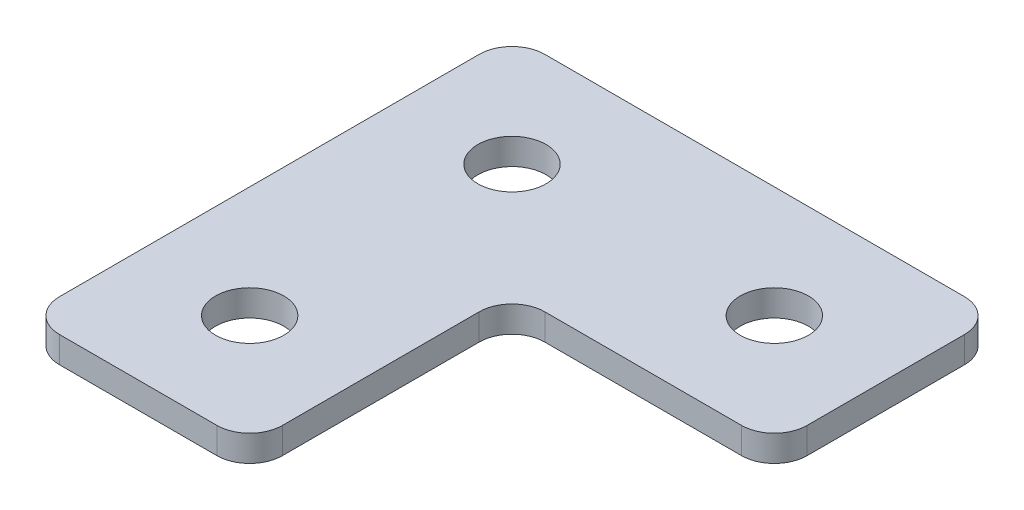
ISO-10303-21;
HEADER;
FILE_DESCRIPTION(('STEP AP214'),'2;1');
FILE_NAME('part.step','',(''),(''),'','','');
FILE_SCHEMA(('AUTOMOTIVE_DESIGN { 1 0 10303 214 1 1 1 1 }'));
ENDSEC;
DATA;
#1=APPLICATION_CONTEXT('core data for automotive mechanical design processes');
#2=APPLICATION_PROTOCOL_DEFINITION('international standard','automotive_design',2000,#1);
#3=PRODUCT_CONTEXT('',#1,'mechanical');
#4=PRODUCT('Part','Part','',(#3));
#5=PRODUCT_RELATED_PRODUCT_CATEGORY('part','',(#4));
#6=PRODUCT_DEFINITION_FORMATION('','',#4);
#7=PRODUCT_DEFINITION_CONTEXT('part definition',#1,'design');
#8=PRODUCT_DEFINITION('design','',#6,#7);
#9=PRODUCT_DEFINITION_SHAPE('','',#8);
#10=(LENGTH_UNIT() NAMED_UNIT(*) SI_UNIT(.MILLI.,.METRE.));
#11=(NAMED_UNIT(*) PLANE_ANGLE_UNIT() SI_UNIT($,.RADIAN.));
#12=(NAMED_UNIT(*) SI_UNIT($,.STERADIAN.) SOLID_ANGLE_UNIT());
#13=UNCERTAINTY_MEASURE_WITH_UNIT(LENGTH_MEASURE(1.E-05),#10,'distance_accuracy_value','');
#14=(GEOMETRIC_REPRESENTATION_CONTEXT(3) GLOBAL_UNCERTAINTY_ASSIGNED_CONTEXT((#13)) GLOBAL_UNIT_ASSIGNED_CONTEXT((#10,
#11,#12)) REPRESENTATION_CONTEXT('',''));
#15=CARTESIAN_POINT('',(0.,0.,0.));
#16=DIRECTION('',(0.,0.,1.));
#17=DIRECTION('',(1.,0.,0.));
#18=AXIS2_PLACEMENT_3D('',#15,#16,#17);
#19=CARTESIAN_POINT('',(20.5676190476191,-1.,-12.9790476190476));
#20=DIRECTION('',(0.,-1.,0.));
#21=DIRECTION('',(0.,0.,-1.));
#22=AXIS2_PLACEMENT_3D('',#19,#20,#21);
#23=PLANE('',#22);
#24=CARTESIAN_POINT('',(20.5676190476191,-1.,7.02095238095242));
#25=DIRECTION('',(0.,1.,0.));
#26=DIRECTION('',(0.,0.,1.));
#27=AXIS2_PLACEMENT_3D('',#24,#25,#26);
#28=CIRCLE('',#27,2.6);
#29=CARTESIAN_POINT('',(20.5676190476191,-1.,9.62095238095242));
#30=VERTEX_POINT('',#29);
#31=EDGE_CURVE('E310',#30,#30,#28,.T.);
#32=ORIENTED_EDGE('',*,*,#31,.T.);
#33=EDGE_LOOP('',(#32));
#34=FACE_BOUND('',#33,.T.);
#35=CARTESIAN_POINT('',(40.5676190476191,-1.,-12.9790476190476));
#36=DIRECTION('',(0.,1.,0.));
#37=DIRECTION('',(0.,0.,1.));
#38=AXIS2_PLACEMENT_3D('',#35,#36,#37);
#39=CIRCLE('',#38,2.6);
#40=CARTESIAN_POINT('',(40.5676190476191,-1.,-10.3790476190476));
#41=VERTEX_POINT('',#40);
#42=EDGE_CURVE('E305',#41,#41,#39,.T.);
#43=ORIENTED_EDGE('',*,*,#42,.T.);
#44=EDGE_LOOP('',(#43));
#45=FACE_BOUND('',#44,.T.);
#46=CARTESIAN_POINT('',(20.5676190476191,-1.,-12.9790476190476));
#47=DIRECTION('',(0.,1.,0.));
#48=DIRECTION('',(0.,0.,1.));
#49=AXIS2_PLACEMENT_3D('',#46,#47,#48);
#50=CIRCLE('',#49,2.6);
#51=CARTESIAN_POINT('',(20.5676190476191,-1.,-10.3790476190476));
#52=VERTEX_POINT('',#51);
#53=EDGE_CURVE('E187',#52,#52,#50,.T.);
#54=ORIENTED_EDGE('',*,*,#53,.T.);
#55=EDGE_LOOP('',(#54));
#56=FACE_BOUND('',#55,.T.);
#57=DIRECTION('',(-1.,0.,0.));
#58=VECTOR('',#57,1.);
#59=CARTESIAN_POINT('',(49.0676190476191,-1.,-21.4790476190476));
#60=LINE('',#59,#58);
#61=CARTESIAN_POINT('',(46.5676190476191,-1.,-21.4790476190476));
#62=VERTEX_POINT('',#61);
#63=CARTESIAN_POINT('',(14.5676190476191,-1.,-21.4790476190476));
#64=VERTEX_POINT('',#63);
#65=EDGE_CURVE('E208',#62,#64,#60,.T.);
#66=ORIENTED_EDGE('',*,*,#65,.F.);
#67=CARTESIAN_POINT('',(46.5676190476191,-1.,-18.9790476190476));
#68=DIRECTION('',(0.,-1.,0.));
#69=DIRECTION('',(0.,0.,-1.));
#70=AXIS2_PLACEMENT_3D('',#67,#68,#69);
#71=CIRCLE('',#70,2.5);
#72=CARTESIAN_POINT('',(49.0676190476191,-1.,-18.9790476190476));
#73=VERTEX_POINT('',#72);
#74=EDGE_CURVE('E159',#62,#73,#71,.T.);
#75=ORIENTED_EDGE('',*,*,#74,.T.);
#76=DIRECTION('',(0.,0.,-1.));
#77=VECTOR('',#76,1.);
#78=CARTESIAN_POINT('',(49.0676190476191,-1.,-4.47904761904754));
#79=LINE('',#78,#77);
#80=CARTESIAN_POINT('',(49.0676190476191,-1.,-6.97904761904754));
#81=VERTEX_POINT('',#80);
#82=EDGE_CURVE('E217',#81,#73,#79,.T.);
#83=ORIENTED_EDGE('',*,*,#82,.F.);
#84=CARTESIAN_POINT('',(46.5676190476191,-1.,-6.97904761904754));
#85=DIRECTION('',(0.,-1.,0.));
#86=DIRECTION('',(0.,0.,-1.));
#87=AXIS2_PLACEMENT_3D('',#84,#85,#86);
#88=CIRCLE('',#87,2.5);
#89=CARTESIAN_POINT('',(46.5676190476191,-1.,-4.47904761904754));
#90=VERTEX_POINT('',#89);
#91=EDGE_CURVE('E131',#81,#90,#88,.T.);
#92=ORIENTED_EDGE('',*,*,#91,.T.);
#93=DIRECTION('',(1.,0.,0.));
#94=VECTOR('',#93,1.);
#95=CARTESIAN_POINT('',(29.0676190476192,-1.,-4.47904761904754));
#96=LINE('',#95,#94);
#97=CARTESIAN_POINT('',(31.5676190476192,-1.,-4.47904761904754));
#98=VERTEX_POINT('',#97);
#99=EDGE_CURVE('E194',#98,#90,#96,.T.);
#100=ORIENTED_EDGE('',*,*,#99,.F.);
#101=CARTESIAN_POINT('',(31.5676190476192,-1.,-1.97904761904754));
#102=DIRECTION('',(0.,-1.,0.));
#103=DIRECTION('',(0.,0.,-1.));
#104=AXIS2_PLACEMENT_3D('',#101,#102,#103);
#105=CIRCLE('',#104,2.5);
#106=CARTESIAN_POINT('',(29.0676190476192,-1.,-1.97904761904754));
#107=VERTEX_POINT('',#106);
#108=EDGE_CURVE('E10',#98,#107,#105,.F.);
#109=ORIENTED_EDGE('',*,*,#108,.T.);
#110=DIRECTION('',(0.,0.,-1.));
#111=VECTOR('',#110,1.);
#112=CARTESIAN_POINT('',(29.0676190476192,-1.,15.5209523809524));
#113=LINE('',#112,#111);
#114=CARTESIAN_POINT('',(29.0676190476192,-1.,13.0209523809524));
#115=VERTEX_POINT('',#114);
#116=EDGE_CURVE('E132',#115,#107,#113,.T.);
#117=ORIENTED_EDGE('',*,*,#116,.F.);
#118=CARTESIAN_POINT('',(26.5676190476192,-1.,13.0209523809524));
#119=DIRECTION('',(0.,-1.,0.));
#120=DIRECTION('',(0.,0.,-1.));
#121=AXIS2_PLACEMENT_3D('',#118,#119,#120);
#122=CIRCLE('',#121,2.5);
#123=CARTESIAN_POINT('',(26.5676190476192,-1.,15.5209523809524));
#124=VERTEX_POINT('',#123);
#125=EDGE_CURVE('E153',#115,#124,#122,.T.);
#126=ORIENTED_EDGE('',*,*,#125,.T.);
#127=DIRECTION('',(1.,0.,0.));
#128=VECTOR('',#127,1.);
#129=CARTESIAN_POINT('',(12.0676190476191,-1.,15.5209523809524));
#130=LINE('',#129,#128);
#131=CARTESIAN_POINT('',(14.5676190476191,-1.,15.5209523809524));
#132=VERTEX_POINT('',#131);
#133=EDGE_CURVE('E136',#132,#124,#130,.T.);
#134=ORIENTED_EDGE('',*,*,#133,.F.);
#135=CARTESIAN_POINT('',(14.5676190476191,-1.,13.0209523809524));
#136=DIRECTION('',(0.,-1.,0.));
#137=DIRECTION('',(0.,0.,-1.));
#138=AXIS2_PLACEMENT_3D('',#135,#136,#137);
#139=CIRCLE('',#138,2.5);
#140=CARTESIAN_POINT('',(12.0676190476191,-1.,13.0209523809524));
#141=VERTEX_POINT('',#140);
#142=EDGE_CURVE('E31',#132,#141,#139,.T.);
#143=ORIENTED_EDGE('',*,*,#142,.T.);
#144=DIRECTION('',(0.,0.,1.));
#145=VECTOR('',#144,1.);
#146=CARTESIAN_POINT('',(12.0676190476191,-1.,-21.4790476190476));
#147=LINE('',#146,#145);
#148=CARTESIAN_POINT('',(12.0676190476191,-1.,-18.9790476190476));
#149=VERTEX_POINT('',#148);
#150=EDGE_CURVE('E206',#149,#141,#147,.T.);
#151=ORIENTED_EDGE('',*,*,#150,.F.);
#152=CARTESIAN_POINT('',(14.5676190476191,-1.,-18.9790476190476));
#153=DIRECTION('',(0.,-1.,0.));
#154=DIRECTION('',(0.,0.,-1.));
#155=AXIS2_PLACEMENT_3D('',#152,#153,#154);
#156=CIRCLE('',#155,2.5);
#157=EDGE_CURVE('E157',#149,#64,#156,.T.);
#158=ORIENTED_EDGE('',*,*,#157,.T.);
#159=EDGE_LOOP('',(#66,#75,#83,#92,#100,#109,#117,#126,#134,#143,#151,#158));
#160=FACE_BOUND('',#159,.T.);
#161=ADVANCED_FACE('F16',(#34,#45,#56,#160),#23,.T.);
#162=CARTESIAN_POINT('',(29.0676190476192,-1.,-4.47904761904754));
#163=DIRECTION('',(0.,0.,1.));
#164=DIRECTION('',(1.,0.,0.));
#165=AXIS2_PLACEMENT_3D('',#162,#163,#164);
#166=PLANE('',#165);
#167=DIRECTION('',(1.,0.,0.));
#168=VECTOR('',#167,1.);
#169=CARTESIAN_POINT('',(29.0676190476192,1.,-4.47904761904754));
#170=LINE('',#169,#168);
#171=CARTESIAN_POINT('',(31.5676190476192,1.,-4.47904761904754));
#172=VERTEX_POINT('',#171);
#173=CARTESIAN_POINT('',(46.5676190476191,1.,-4.47904761904754));
#174=VERTEX_POINT('',#173);
#175=EDGE_CURVE('E111',#172,#174,#170,.T.);
#176=ORIENTED_EDGE('',*,*,#175,.F.);
#177=DIRECTION('',(0.,1.,0.));
#178=VECTOR('',#177,1.);
#179=CARTESIAN_POINT('',(31.5676190476192,-1.,-4.47904761904754));
#180=LINE('',#179,#178);
#181=EDGE_CURVE('E177',#172,#98,#180,.F.);
#182=ORIENTED_EDGE('',*,*,#181,.T.);
#183=ORIENTED_EDGE('',*,*,#99,.T.);
#184=DIRECTION('',(0.,1.,0.));
#185=VECTOR('',#184,1.);
#186=CARTESIAN_POINT('',(46.5676190476191,-1.,-4.47904761904754));
#187=LINE('',#186,#185);
#188=EDGE_CURVE('E175',#90,#174,#187,.T.);
#189=ORIENTED_EDGE('',*,*,#188,.T.);
#190=EDGE_LOOP('',(#176,#182,#183,#189));
#191=FACE_BOUND('',#190,.T.);
#192=ADVANCED_FACE('F184',(#191),#166,.T.);
#193=CARTESIAN_POINT('',(29.0676190476192,-1.,15.5209523809524));
#194=DIRECTION('',(1.,0.,0.));
#195=DIRECTION('',(0.,0.,-1.));
#196=AXIS2_PLACEMENT_3D('',#193,#194,#195);
#197=PLANE('',#196);
#198=ORIENTED_EDGE('',*,*,#116,.T.);
#199=DIRECTION('',(0.,1.,0.));
#200=VECTOR('',#199,1.);
#201=CARTESIAN_POINT('',(29.0676190476192,1.,-1.97904761904754));
#202=LINE('',#201,#200);
#203=CARTESIAN_POINT('',(29.0676190476192,1.,-1.97904761904754));
#204=VERTEX_POINT('',#203);
#205=EDGE_CURVE('E172',#107,#204,#202,.T.);
#206=ORIENTED_EDGE('',*,*,#205,.T.);
#207=DIRECTION('',(0.,0.,-1.));
#208=VECTOR('',#207,1.);
#209=CARTESIAN_POINT('',(29.0676190476192,1.,15.5209523809524));
#210=LINE('',#209,#208);
#211=CARTESIAN_POINT('',(29.0676190476192,1.,13.0209523809524));
#212=VERTEX_POINT('',#211);
#213=EDGE_CURVE('E139',#212,#204,#210,.T.);
#214=ORIENTED_EDGE('',*,*,#213,.F.);
#215=DIRECTION('',(0.,1.,0.));
#216=VECTOR('',#215,1.);
#217=CARTESIAN_POINT('',(29.0676190476192,-1.,13.0209523809524));
#218=LINE('',#217,#216);
#219=EDGE_CURVE('E170',#212,#115,#218,.F.);
#220=ORIENTED_EDGE('',*,*,#219,.T.);
#221=EDGE_LOOP('',(#198,#206,#214,#220));
#222=FACE_BOUND('',#221,.T.);
#223=ADVANCED_FACE('F196',(#222),#197,.T.);
#224=CARTESIAN_POINT('',(12.0676190476191,-1.,15.5209523809524));
#225=DIRECTION('',(0.,0.,1.));
#226=DIRECTION('',(1.,0.,0.));
#227=AXIS2_PLACEMENT_3D('',#224,#225,#226);
#228=PLANE('',#227);
#229=DIRECTION('',(1.,0.,0.));
#230=VECTOR('',#229,1.);
#231=CARTESIAN_POINT('',(12.0676190476191,1.,15.5209523809524));
#232=LINE('',#231,#230);
#233=CARTESIAN_POINT('',(14.5676190476191,1.,15.5209523809524));
#234=VERTEX_POINT('',#233);
#235=CARTESIAN_POINT('',(26.5676190476192,1.,15.5209523809524));
#236=VERTEX_POINT('',#235);
#237=EDGE_CURVE('E216',#234,#236,#232,.T.);
#238=ORIENTED_EDGE('',*,*,#237,.F.);
#239=DIRECTION('',(0.,1.,0.));
#240=VECTOR('',#239,1.);
#241=CARTESIAN_POINT('',(14.5676190476191,-1.,15.5209523809524));
#242=LINE('',#241,#240);
#243=EDGE_CURVE('E168',#234,#132,#242,.F.);
#244=ORIENTED_EDGE('',*,*,#243,.T.);
#245=ORIENTED_EDGE('',*,*,#133,.T.);
#246=DIRECTION('',(0.,1.,0.));
#247=VECTOR('',#246,1.);
#248=CARTESIAN_POINT('',(26.5676190476192,-1.,15.5209523809524));
#249=LINE('',#248,#247);
#250=EDGE_CURVE('E165',#124,#236,#249,.T.);
#251=ORIENTED_EDGE('',*,*,#250,.T.);
#252=EDGE_LOOP('',(#238,#244,#245,#251));
#253=FACE_BOUND('',#252,.T.);
#254=ADVANCED_FACE('F203',(#253),#228,.T.);
#255=CARTESIAN_POINT('',(12.0676190476191,-1.,-21.4790476190476));
#256=DIRECTION('',(-1.,0.,0.));
#257=DIRECTION('',(0.,0.,1.));
#258=AXIS2_PLACEMENT_3D('',#255,#256,#257);
#259=PLANE('',#258);
#260=DIRECTION('',(0.,0.,1.));
#261=VECTOR('',#260,1.);
#262=CARTESIAN_POINT('',(12.0676190476191,1.,-21.4790476190476));
#263=LINE('',#262,#261);
#264=CARTESIAN_POINT('',(12.0676190476191,1.,-18.9790476190476));
#265=VERTEX_POINT('',#264);
#266=CARTESIAN_POINT('',(12.0676190476191,1.,13.0209523809524));
#267=VERTEX_POINT('',#266);
#268=EDGE_CURVE('E214',#265,#267,#263,.T.);
#269=ORIENTED_EDGE('',*,*,#268,.F.);
#270=DIRECTION('',(0.,1.,0.));
#271=VECTOR('',#270,1.);
#272=CARTESIAN_POINT('',(12.0676190476191,-1.,-18.9790476190476));
#273=LINE('',#272,#271);
#274=EDGE_CURVE('E38',#265,#149,#273,.F.);
#275=ORIENTED_EDGE('',*,*,#274,.T.);
#276=ORIENTED_EDGE('',*,*,#150,.T.);
#277=DIRECTION('',(0.,1.,0.));
#278=VECTOR('',#277,1.);
#279=CARTESIAN_POINT('',(12.0676190476191,-1.,13.0209523809524));
#280=LINE('',#279,#278);
#281=EDGE_CURVE('E161',#141,#267,#280,.T.);
#282=ORIENTED_EDGE('',*,*,#281,.T.);
#283=EDGE_LOOP('',(#269,#275,#276,#282));
#284=FACE_BOUND('',#283,.T.);
#285=ADVANCED_FACE('F233',(#284),#259,.T.);
#286=CARTESIAN_POINT('',(49.0676190476191,-1.,-21.4790476190476));
#287=DIRECTION('',(0.,0.,-1.));
#288=DIRECTION('',(-1.,0.,0.));
#289=AXIS2_PLACEMENT_3D('',#286,#287,#288);
#290=PLANE('',#289);
#291=DIRECTION('',(-1.,0.,0.));
#292=VECTOR('',#291,1.);
#293=CARTESIAN_POINT('',(49.0676190476191,1.,-21.4790476190476));
#294=LINE('',#293,#292);
#295=CARTESIAN_POINT('',(46.5676190476191,1.,-21.4790476190476));
#296=VERTEX_POINT('',#295);
#297=CARTESIAN_POINT('',(14.5676190476191,1.,-21.4790476190476));
#298=VERTEX_POINT('',#297);
#299=EDGE_CURVE('E127',#296,#298,#294,.T.);
#300=ORIENTED_EDGE('',*,*,#299,.F.);
#301=DIRECTION('',(0.,1.,0.));
#302=VECTOR('',#301,1.);
#303=CARTESIAN_POINT('',(46.5676190476191,-1.,-21.4790476190476));
#304=LINE('',#303,#302);
#305=EDGE_CURVE('E151',#296,#62,#304,.F.);
#306=ORIENTED_EDGE('',*,*,#305,.T.);
#307=ORIENTED_EDGE('',*,*,#65,.T.);
#308=DIRECTION('',(0.,1.,0.));
#309=VECTOR('',#308,1.);
#310=CARTESIAN_POINT('',(14.5676190476191,-1.,-21.4790476190476));
#311=LINE('',#310,#309);
#312=EDGE_CURVE('E148',#64,#298,#311,.T.);
#313=ORIENTED_EDGE('',*,*,#312,.T.);
#314=EDGE_LOOP('',(#300,#306,#307,#313));
#315=FACE_BOUND('',#314,.T.);
#316=ADVANCED_FACE('F227',(#315),#290,.T.);
#317=CARTESIAN_POINT('',(49.0676190476191,-1.,-4.47904761904754));
#318=DIRECTION('',(1.,0.,0.));
#319=DIRECTION('',(0.,0.,-1.));
#320=AXIS2_PLACEMENT_3D('',#317,#318,#319);
#321=PLANE('',#320);
#322=ORIENTED_EDGE('',*,*,#82,.T.);
#323=DIRECTION('',(0.,1.,0.));
#324=VECTOR('',#323,1.);
#325=CARTESIAN_POINT('',(49.0676190476191,-1.,-18.9790476190476));
#326=LINE('',#325,#324);
#327=CARTESIAN_POINT('',(49.0676190476191,1.,-18.9790476190476));
#328=VERTEX_POINT('',#327);
#329=EDGE_CURVE('E126',#73,#328,#326,.T.);
#330=ORIENTED_EDGE('',*,*,#329,.T.);
#331=DIRECTION('',(0.,0.,-1.));
#332=VECTOR('',#331,1.);
#333=CARTESIAN_POINT('',(49.0676190476191,1.,-4.47904761904754));
#334=LINE('',#333,#332);
#335=CARTESIAN_POINT('',(49.0676190476191,1.,-6.97904761904754));
#336=VERTEX_POINT('',#335);
#337=EDGE_CURVE('E109',#336,#328,#334,.T.);
#338=ORIENTED_EDGE('',*,*,#337,.F.);
#339=DIRECTION('',(0.,1.,0.));
#340=VECTOR('',#339,1.);
#341=CARTESIAN_POINT('',(49.0676190476191,-1.,-6.97904761904754));
#342=LINE('',#341,#340);
#343=EDGE_CURVE('E123',#336,#81,#342,.F.);
#344=ORIENTED_EDGE('',*,*,#343,.T.);
#345=EDGE_LOOP('',(#322,#330,#338,#344));
#346=FACE_BOUND('',#345,.T.);
#347=ADVANCED_FACE('F122',(#346),#321,.T.);
#348=CARTESIAN_POINT('',(20.5676190476191,1.,-12.9790476190476));
#349=DIRECTION('',(0.,-1.,0.));
#350=DIRECTION('',(0.,0.,-1.));
#351=AXIS2_PLACEMENT_3D('',#348,#349,#350);
#352=PLANE('',#351);
#353=CARTESIAN_POINT('',(20.5676190476191,1.,7.02095238095242));
#354=DIRECTION('',(0.,1.,0.));
#355=DIRECTION('',(0.,0.,1.));
#356=AXIS2_PLACEMENT_3D('',#353,#354,#355);
#357=CIRCLE('',#356,2.6);
#358=CARTESIAN_POINT('',(20.5676190476191,1.,9.62095238095242));
#359=VERTEX_POINT('',#358);
#360=EDGE_CURVE('E297',#359,#359,#357,.T.);
#361=ORIENTED_EDGE('',*,*,#360,.F.);
#362=EDGE_LOOP('',(#361));
#363=FACE_BOUND('',#362,.T.);
#364=CARTESIAN_POINT('',(40.5676190476191,1.,-12.9790476190476));
#365=DIRECTION('',(0.,1.,0.));
#366=DIRECTION('',(0.,0.,1.));
#367=AXIS2_PLACEMENT_3D('',#364,#365,#366);
#368=CIRCLE('',#367,2.6);
#369=CARTESIAN_POINT('',(40.5676190476191,1.,-10.3790476190476));
#370=VERTEX_POINT('',#369);
#371=EDGE_CURVE('E301',#370,#370,#368,.T.);
#372=ORIENTED_EDGE('',*,*,#371,.F.);
#373=EDGE_LOOP('',(#372));
#374=FACE_BOUND('',#373,.T.);
#375=CARTESIAN_POINT('',(20.5676190476191,1.,-12.9790476190476));
#376=DIRECTION('',(0.,1.,0.));
#377=DIRECTION('',(0.,0.,1.));
#378=AXIS2_PLACEMENT_3D('',#375,#376,#377);
#379=CIRCLE('',#378,2.6);
#380=CARTESIAN_POINT('',(20.5676190476191,1.,-10.3790476190476));
#381=VERTEX_POINT('',#380);
#382=EDGE_CURVE('E221',#381,#381,#379,.T.);
#383=ORIENTED_EDGE('',*,*,#382,.F.);
#384=EDGE_LOOP('',(#383));
#385=FACE_BOUND('',#384,.T.);
#386=ORIENTED_EDGE('',*,*,#337,.T.);
#387=CARTESIAN_POINT('',(46.5676190476191,1.,-18.9790476190476));
#388=DIRECTION('',(0.,-1.,0.));
#389=DIRECTION('',(0.,0.,-1.));
#390=AXIS2_PLACEMENT_3D('',#387,#388,#389);
#391=CIRCLE('',#390,2.5);
#392=EDGE_CURVE('E146',#328,#296,#391,.F.);
#393=ORIENTED_EDGE('',*,*,#392,.T.);
#394=ORIENTED_EDGE('',*,*,#299,.T.);
#395=CARTESIAN_POINT('',(14.5676190476191,1.,-18.9790476190476));
#396=DIRECTION('',(0.,-1.,0.));
#397=DIRECTION('',(0.,0.,-1.));
#398=AXIS2_PLACEMENT_3D('',#395,#396,#397);
#399=CIRCLE('',#398,2.5);
#400=EDGE_CURVE('E144',#298,#265,#399,.F.);
#401=ORIENTED_EDGE('',*,*,#400,.T.);
#402=ORIENTED_EDGE('',*,*,#268,.T.);
#403=CARTESIAN_POINT('',(14.5676190476191,1.,13.0209523809524));
#404=DIRECTION('',(0.,-1.,0.));
#405=DIRECTION('',(0.,0.,-1.));
#406=AXIS2_PLACEMENT_3D('',#403,#404,#405);
#407=CIRCLE('',#406,2.5);
#408=EDGE_CURVE('E116',#267,#234,#407,.F.);
#409=ORIENTED_EDGE('',*,*,#408,.T.);
#410=ORIENTED_EDGE('',*,*,#237,.T.);
#411=CARTESIAN_POINT('',(26.5676190476192,1.,13.0209523809524));
#412=DIRECTION('',(0.,-1.,0.));
#413=DIRECTION('',(0.,0.,-1.));
#414=AXIS2_PLACEMENT_3D('',#411,#412,#413);
#415=CIRCLE('',#414,2.5);
#416=EDGE_CURVE('E117',#236,#212,#415,.F.);
#417=ORIENTED_EDGE('',*,*,#416,.T.);
#418=ORIENTED_EDGE('',*,*,#213,.T.);
#419=CARTESIAN_POINT('',(31.5676190476192,1.,-1.97904761904754));
#420=DIRECTION('',(0.,-1.,0.));
#421=DIRECTION('',(0.,0.,-1.));
#422=AXIS2_PLACEMENT_3D('',#419,#420,#421);
#423=CIRCLE('',#422,2.5);
#424=EDGE_CURVE('E24',#204,#172,#423,.T.);
#425=ORIENTED_EDGE('',*,*,#424,.T.);
#426=ORIENTED_EDGE('',*,*,#175,.T.);
#427=CARTESIAN_POINT('',(46.5676190476191,1.,-6.97904761904754));
#428=DIRECTION('',(0.,-1.,0.));
#429=DIRECTION('',(0.,0.,-1.));
#430=AXIS2_PLACEMENT_3D('',#427,#428,#429);
#431=CIRCLE('',#430,2.5);
#432=EDGE_CURVE('E106',#174,#336,#431,.F.);
#433=ORIENTED_EDGE('',*,*,#432,.T.);
#434=EDGE_LOOP('',(#386,#393,#394,#401,#402,#409,#410,#417,#418,#425,#426,#433));
#435=FACE_BOUND('',#434,.T.);
#436=ADVANCED_FACE('F108',(#363,#374,#385,#435),#352,.F.);
#437=CARTESIAN_POINT('',(20.5676190476191,-1.,-12.9790476190476));
#438=DIRECTION('',(0.,1.,0.));
#439=DIRECTION('',(0.,0.,1.));
#440=AXIS2_PLACEMENT_3D('',#437,#438,#439);
#441=CYLINDRICAL_SURFACE('',#440,2.6);
#442=ORIENTED_EDGE('',*,*,#53,.F.);
#443=EDGE_LOOP('',(#442));
#444=FACE_BOUND('',#443,.T.);
#445=ORIENTED_EDGE('',*,*,#382,.T.);
#446=EDGE_LOOP('',(#445));
#447=FACE_BOUND('',#446,.T.);
#448=ADVANCED_FACE('F270',(#444,#447),#441,.F.);
#449=CARTESIAN_POINT('',(40.5676190476191,-1.,-12.9790476190476));
#450=DIRECTION('',(0.,1.,0.));
#451=DIRECTION('',(0.,0.,1.));
#452=AXIS2_PLACEMENT_3D('',#449,#450,#451);
#453=CYLINDRICAL_SURFACE('',#452,2.6);
#454=ORIENTED_EDGE('',*,*,#42,.F.);
#455=EDGE_LOOP('',(#454));
#456=FACE_BOUND('',#455,.T.);
#457=ORIENTED_EDGE('',*,*,#371,.T.);
#458=EDGE_LOOP('',(#457));
#459=FACE_BOUND('',#458,.T.);
#460=ADVANCED_FACE('F264',(#456,#459),#453,.F.);
#461=CARTESIAN_POINT('',(20.5676190476191,-1.,7.02095238095242));
#462=DIRECTION('',(0.,1.,0.));
#463=DIRECTION('',(0.,0.,1.));
#464=AXIS2_PLACEMENT_3D('',#461,#462,#463);
#465=CYLINDRICAL_SURFACE('',#464,2.6);
#466=ORIENTED_EDGE('',*,*,#31,.F.);
#467=EDGE_LOOP('',(#466));
#468=FACE_BOUND('',#467,.T.);
#469=ORIENTED_EDGE('',*,*,#360,.T.);
#470=EDGE_LOOP('',(#469));
#471=FACE_BOUND('',#470,.T.);
#472=ADVANCED_FACE('F259',(#468,#471),#465,.F.);
#473=CARTESIAN_POINT('',(46.5676190476191,-1.,-18.9790476190476));
#474=DIRECTION('',(0.,1.,0.));
#475=DIRECTION('',(0.,0.,1.));
#476=AXIS2_PLACEMENT_3D('',#473,#474,#475);
#477=CYLINDRICAL_SURFACE('',#476,2.5);
#478=ORIENTED_EDGE('',*,*,#74,.F.);
#479=ORIENTED_EDGE('',*,*,#305,.F.);
#480=ORIENTED_EDGE('',*,*,#392,.F.);
#481=ORIENTED_EDGE('',*,*,#329,.F.);
#482=EDGE_LOOP('',(#478,#479,#480,#481));
#483=FACE_BOUND('',#482,.T.);
#484=ADVANCED_FACE('F245',(#483),#477,.T.);
#485=CARTESIAN_POINT('',(14.5676190476191,-1.,-18.9790476190476));
#486=DIRECTION('',(0.,1.,0.));
#487=DIRECTION('',(0.,0.,1.));
#488=AXIS2_PLACEMENT_3D('',#485,#486,#487);
#489=CYLINDRICAL_SURFACE('',#488,2.5);
#490=ORIENTED_EDGE('',*,*,#157,.F.);
#491=ORIENTED_EDGE('',*,*,#274,.F.);
#492=ORIENTED_EDGE('',*,*,#400,.F.);
#493=ORIENTED_EDGE('',*,*,#312,.F.);
#494=EDGE_LOOP('',(#490,#491,#492,#493));
#495=FACE_BOUND('',#494,.T.);
#496=ADVANCED_FACE('F232',(#495),#489,.T.);
#497=CARTESIAN_POINT('',(14.5676190476191,-1.,13.0209523809524));
#498=DIRECTION('',(0.,1.,0.));
#499=DIRECTION('',(0.,0.,1.));
#500=AXIS2_PLACEMENT_3D('',#497,#498,#499);
#501=CYLINDRICAL_SURFACE('',#500,2.5);
#502=ORIENTED_EDGE('',*,*,#142,.F.);
#503=ORIENTED_EDGE('',*,*,#243,.F.);
#504=ORIENTED_EDGE('',*,*,#408,.F.);
#505=ORIENTED_EDGE('',*,*,#281,.F.);
#506=EDGE_LOOP('',(#502,#503,#504,#505));
#507=FACE_BOUND('',#506,.T.);
#508=ADVANCED_FACE('F236',(#507),#501,.T.);
#509=CARTESIAN_POINT('',(31.5676190476192,-1.,-1.97904761904754));
#510=DIRECTION('',(0.,-1.,0.));
#511=DIRECTION('',(0.,0.,-1.));
#512=AXIS2_PLACEMENT_3D('',#509,#510,#511);
#513=CYLINDRICAL_SURFACE('',#512,2.5);
#514=ORIENTED_EDGE('',*,*,#108,.F.);
#515=ORIENTED_EDGE('',*,*,#181,.F.);
#516=ORIENTED_EDGE('',*,*,#424,.F.);
#517=ORIENTED_EDGE('',*,*,#205,.F.);
#518=EDGE_LOOP('',(#514,#515,#516,#517));
#519=FACE_BOUND('',#518,.T.);
#520=ADVANCED_FACE('F190',(#519),#513,.F.);
#521=CARTESIAN_POINT('',(46.5676190476191,-1.,-6.97904761904754));
#522=DIRECTION('',(0.,1.,0.));
#523=DIRECTION('',(0.,0.,1.));
#524=AXIS2_PLACEMENT_3D('',#521,#522,#523);
#525=CYLINDRICAL_SURFACE('',#524,2.5);
#526=ORIENTED_EDGE('',*,*,#91,.F.);
#527=ORIENTED_EDGE('',*,*,#343,.F.);
#528=ORIENTED_EDGE('',*,*,#432,.F.);
#529=ORIENTED_EDGE('',*,*,#188,.F.);
#530=EDGE_LOOP('',(#526,#527,#528,#529));
#531=FACE_BOUND('',#530,.T.);
#532=ADVANCED_FACE('F130',(#531),#525,.T.);
#533=CARTESIAN_POINT('',(26.5676190476192,-1.,13.0209523809524));
#534=DIRECTION('',(0.,1.,0.));
#535=DIRECTION('',(0.,0.,1.));
#536=AXIS2_PLACEMENT_3D('',#533,#534,#535);
#537=CYLINDRICAL_SURFACE('',#536,2.5);
#538=ORIENTED_EDGE('',*,*,#125,.F.);
#539=ORIENTED_EDGE('',*,*,#219,.F.);
#540=ORIENTED_EDGE('',*,*,#416,.F.);
#541=ORIENTED_EDGE('',*,*,#250,.F.);
#542=EDGE_LOOP('',(#538,#539,#540,#541));
#543=FACE_BOUND('',#542,.T.);
#544=ADVANCED_FACE('F18',(#543),#537,.T.);
#545=CLOSED_SHELL('',(#161,#192,#223,#254,#285,#316,#347,#436,#448,#460,#472,#484,#496,#508,
#520,#532,#544));
#546=MANIFOLD_SOLID_BREP('B1',#545);
#547=ADVANCED_BREP_SHAPE_REPRESENTATION('',(#18,#546),#14);
#548=SHAPE_DEFINITION_REPRESENTATION(#9,#547);
ENDSEC;
END-ISO-10303-21;
